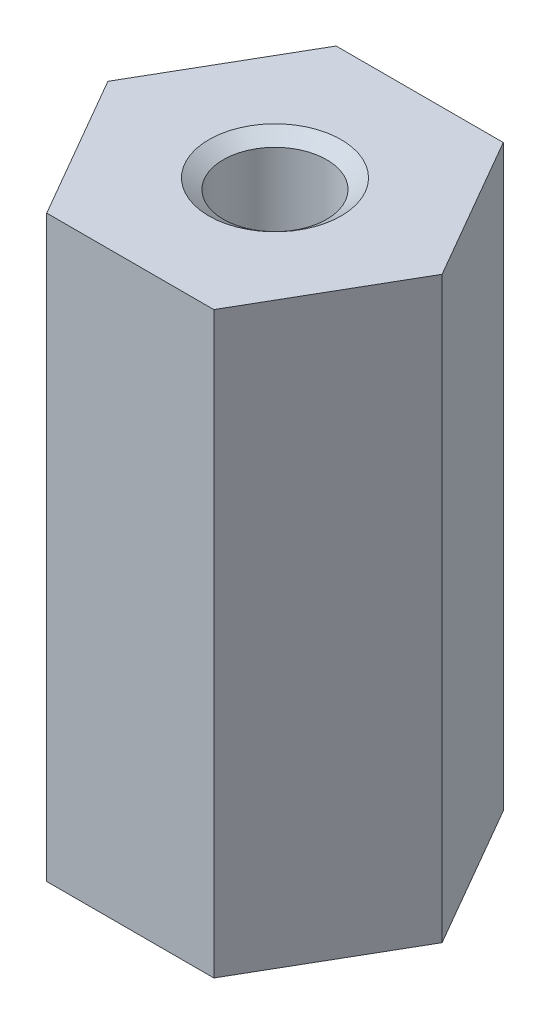
ISO-10303-21;
HEADER;
FILE_DESCRIPTION(('STEP AP214'),'2;1');
FILE_NAME('part.step','',(''),(''),'','','');
FILE_SCHEMA(('AUTOMOTIVE_DESIGN { 1 0 10303 214 1 1 1 1 }'));
ENDSEC;
DATA;
#1=APPLICATION_CONTEXT('core data for automotive mechanical design processes');
#2=APPLICATION_PROTOCOL_DEFINITION('international standard','automotive_design',2000,#1);
#3=PRODUCT_CONTEXT('',#1,'mechanical');
#4=PRODUCT('Part','Part','',(#3));
#5=PRODUCT_RELATED_PRODUCT_CATEGORY('part','',(#4));
#6=PRODUCT_DEFINITION_FORMATION('','',#4);
#7=PRODUCT_DEFINITION_CONTEXT('part definition',#1,'design');
#8=PRODUCT_DEFINITION('design','',#6,#7);
#9=PRODUCT_DEFINITION_SHAPE('','',#8);
#10=(LENGTH_UNIT() NAMED_UNIT(*) SI_UNIT(.MILLI.,.METRE.));
#11=(NAMED_UNIT(*) PLANE_ANGLE_UNIT() SI_UNIT($,.RADIAN.));
#12=(NAMED_UNIT(*) SI_UNIT($,.STERADIAN.) SOLID_ANGLE_UNIT());
#13=UNCERTAINTY_MEASURE_WITH_UNIT(LENGTH_MEASURE(1.E-05),#10,'distance_accuracy_value','');
#14=(GEOMETRIC_REPRESENTATION_CONTEXT(3) GLOBAL_UNCERTAINTY_ASSIGNED_CONTEXT((#13)) GLOBAL_UNIT_ASSIGNED_CONTEXT((#10,
#11,#12)) REPRESENTATION_CONTEXT('',''));
#15=CARTESIAN_POINT('',(0.,0.,0.));
#16=DIRECTION('',(0.,0.,1.));
#17=DIRECTION('',(1.,0.,0.));
#18=AXIS2_PLACEMENT_3D('',#15,#16,#17);
#19=CARTESIAN_POINT('',(2.02072594216369,14.,3.50000000000001));
#20=DIRECTION('',(-0.866025403784439,0.,-0.5));
#21=DIRECTION('',(-0.5,0.,0.866025403784439));
#22=AXIS2_PLACEMENT_3D('',#19,#20,#21);
#23=PLANE('',#22);
#24=DIRECTION('',(0.5,0.,-0.866025403784439));
#25=VECTOR('',#24,1.);
#26=CARTESIAN_POINT('',(2.02072594216369,0.,3.50000000000001));
#27=LINE('',#26,#25);
#28=CARTESIAN_POINT('',(2.02072594216369,0.,3.50000000000001));
#29=VERTEX_POINT('',#28);
#30=CARTESIAN_POINT('',(4.04145188432738,0.,0.));
#31=VERTEX_POINT('',#30);
#32=EDGE_CURVE('E115',#29,#31,#27,.T.);
#33=ORIENTED_EDGE('',*,*,#32,.T.);
#34=DIRECTION('',(0.,-1.,0.));
#35=VECTOR('',#34,1.);
#36=CARTESIAN_POINT('',(4.04145188432738,14.,0.));
#37=LINE('',#36,#35);
#38=CARTESIAN_POINT('',(4.04145188432738,14.,0.));
#39=VERTEX_POINT('',#38);
#40=EDGE_CURVE('E11',#39,#31,#37,.T.);
#41=ORIENTED_EDGE('',*,*,#40,.F.);
#42=DIRECTION('',(0.5,0.,-0.866025403784439));
#43=VECTOR('',#42,1.);
#44=CARTESIAN_POINT('',(2.02072594216369,14.,3.50000000000001));
#45=LINE('',#44,#43);
#46=CARTESIAN_POINT('',(2.02072594216369,14.,3.50000000000001));
#47=VERTEX_POINT('',#46);
#48=EDGE_CURVE('E126',#47,#39,#45,.T.);
#49=ORIENTED_EDGE('',*,*,#48,.F.);
#50=DIRECTION('',(0.,-1.,0.));
#51=VECTOR('',#50,1.);
#52=CARTESIAN_POINT('',(2.02072594216369,14.,3.50000000000001));
#53=LINE('',#52,#51);
#54=EDGE_CURVE('E111',#47,#29,#53,.T.);
#55=ORIENTED_EDGE('',*,*,#54,.T.);
#56=EDGE_LOOP('',(#33,#41,#49,#55));
#57=FACE_BOUND('',#56,.T.);
#58=ADVANCED_FACE('F31',(#57),#23,.F.);
#59=CARTESIAN_POINT('',(4.04145188432738,14.,0.));
#60=DIRECTION('',(-0.866025403784439,0.,0.5));
#61=DIRECTION('',(0.5,0.,0.866025403784439));
#62=AXIS2_PLACEMENT_3D('',#59,#60,#61);
#63=PLANE('',#62);
#64=DIRECTION('',(-0.5,0.,-0.866025403784439));
#65=VECTOR('',#64,1.);
#66=CARTESIAN_POINT('',(4.04145188432738,0.,0.));
#67=LINE('',#66,#65);
#68=CARTESIAN_POINT('',(2.02072594216368,0.,-3.50000000000001));
#69=VERTEX_POINT('',#68);
#70=EDGE_CURVE('E118',#31,#69,#67,.T.);
#71=ORIENTED_EDGE('',*,*,#70,.T.);
#72=DIRECTION('',(0.,-1.,0.));
#73=VECTOR('',#72,1.);
#74=CARTESIAN_POINT('',(2.02072594216368,14.,-3.50000000000001));
#75=LINE('',#74,#73);
#76=CARTESIAN_POINT('',(2.02072594216368,14.,-3.50000000000001));
#77=VERTEX_POINT('',#76);
#78=EDGE_CURVE('E39',#77,#69,#75,.T.);
#79=ORIENTED_EDGE('',*,*,#78,.F.);
#80=DIRECTION('',(-0.5,0.,-0.866025403784439));
#81=VECTOR('',#80,1.);
#82=CARTESIAN_POINT('',(4.04145188432738,14.,0.));
#83=LINE('',#82,#81);
#84=EDGE_CURVE('E84',#39,#77,#83,.T.);
#85=ORIENTED_EDGE('',*,*,#84,.F.);
#86=ORIENTED_EDGE('',*,*,#40,.T.);
#87=EDGE_LOOP('',(#71,#79,#85,#86));
#88=FACE_BOUND('',#87,.T.);
#89=ADVANCED_FACE('F151',(#88),#63,.F.);
#90=CARTESIAN_POINT('',(2.02072594216368,14.,-3.50000000000001));
#91=DIRECTION('',(0.,0.,1.));
#92=DIRECTION('',(1.,0.,0.));
#93=AXIS2_PLACEMENT_3D('',#90,#91,#92);
#94=PLANE('',#93);
#95=DIRECTION('',(-1.,0.,0.));
#96=VECTOR('',#95,1.);
#97=CARTESIAN_POINT('',(2.02072594216368,0.,-3.50000000000001));
#98=LINE('',#97,#96);
#99=CARTESIAN_POINT('',(-2.02072594216369,0.,-3.50000000000001));
#100=VERTEX_POINT('',#99);
#101=EDGE_CURVE('E121',#69,#100,#98,.T.);
#102=ORIENTED_EDGE('',*,*,#101,.T.);
#103=DIRECTION('',(0.,-1.,0.));
#104=VECTOR('',#103,1.);
#105=CARTESIAN_POINT('',(-2.02072594216369,14.,-3.50000000000001));
#106=LINE('',#105,#104);
#107=CARTESIAN_POINT('',(-2.02072594216369,14.,-3.50000000000001));
#108=VERTEX_POINT('',#107);
#109=EDGE_CURVE('E106',#108,#100,#106,.T.);
#110=ORIENTED_EDGE('',*,*,#109,.F.);
#111=DIRECTION('',(-1.,0.,0.));
#112=VECTOR('',#111,1.);
#113=CARTESIAN_POINT('',(2.02072594216368,14.,-3.50000000000001));
#114=LINE('',#113,#112);
#115=EDGE_CURVE('E97',#77,#108,#114,.T.);
#116=ORIENTED_EDGE('',*,*,#115,.F.);
#117=ORIENTED_EDGE('',*,*,#78,.T.);
#118=EDGE_LOOP('',(#102,#110,#116,#117));
#119=FACE_BOUND('',#118,.T.);
#120=ADVANCED_FACE('F132',(#119),#94,.F.);
#121=CARTESIAN_POINT('',(-2.02072594216369,14.,-3.50000000000001));
#122=DIRECTION('',(0.866025403784438,0.,0.5));
#123=DIRECTION('',(0.5,0.,-0.866025403784439));
#124=AXIS2_PLACEMENT_3D('',#121,#122,#123);
#125=PLANE('',#124);
#126=DIRECTION('',(-0.5,0.,0.866025403784438));
#127=VECTOR('',#126,1.);
#128=CARTESIAN_POINT('',(-2.02072594216369,0.,-3.50000000000001));
#129=LINE('',#128,#127);
#130=CARTESIAN_POINT('',(-4.04145188432739,0.,0.));
#131=VERTEX_POINT('',#130);
#132=EDGE_CURVE('E105',#100,#131,#129,.T.);
#133=ORIENTED_EDGE('',*,*,#132,.T.);
#134=DIRECTION('',(0.,-1.,0.));
#135=VECTOR('',#134,1.);
#136=CARTESIAN_POINT('',(-4.04145188432739,14.,0.));
#137=LINE('',#136,#135);
#138=CARTESIAN_POINT('',(-4.04145188432739,14.,0.));
#139=VERTEX_POINT('',#138);
#140=EDGE_CURVE('E102',#139,#131,#137,.T.);
#141=ORIENTED_EDGE('',*,*,#140,.F.);
#142=DIRECTION('',(-0.5,0.,0.866025403784438));
#143=VECTOR('',#142,1.);
#144=CARTESIAN_POINT('',(-2.02072594216369,14.,-3.50000000000001));
#145=LINE('',#144,#143);
#146=EDGE_CURVE('E91',#108,#139,#145,.T.);
#147=ORIENTED_EDGE('',*,*,#146,.F.);
#148=ORIENTED_EDGE('',*,*,#109,.T.);
#149=EDGE_LOOP('',(#133,#141,#147,#148));
#150=FACE_BOUND('',#149,.T.);
#151=ADVANCED_FACE('F103',(#150),#125,.F.);
#152=CARTESIAN_POINT('',(-4.04145188432739,14.,0.));
#153=DIRECTION('',(0.866025403784439,0.,-0.5));
#154=DIRECTION('',(-0.5,0.,-0.866025403784439));
#155=AXIS2_PLACEMENT_3D('',#152,#153,#154);
#156=PLANE('',#155);
#157=DIRECTION('',(0.5,0.,0.866025403784439));
#158=VECTOR('',#157,1.);
#159=CARTESIAN_POINT('',(-4.04145188432739,0.,0.));
#160=LINE('',#159,#158);
#161=CARTESIAN_POINT('',(-2.0207259421637,0.,3.50000000000001));
#162=VERTEX_POINT('',#161);
#163=EDGE_CURVE('E70',#131,#162,#160,.T.);
#164=ORIENTED_EDGE('',*,*,#163,.T.);
#165=DIRECTION('',(0.,-1.,0.));
#166=VECTOR('',#165,1.);
#167=CARTESIAN_POINT('',(-2.0207259421637,14.,3.50000000000001));
#168=LINE('',#167,#166);
#169=CARTESIAN_POINT('',(-2.0207259421637,14.,3.50000000000001));
#170=VERTEX_POINT('',#169);
#171=EDGE_CURVE('E107',#170,#162,#168,.T.);
#172=ORIENTED_EDGE('',*,*,#171,.F.);
#173=DIRECTION('',(0.5,0.,0.866025403784439));
#174=VECTOR('',#173,1.);
#175=CARTESIAN_POINT('',(-4.04145188432739,14.,0.));
#176=LINE('',#175,#174);
#177=EDGE_CURVE('E95',#139,#170,#176,.T.);
#178=ORIENTED_EDGE('',*,*,#177,.F.);
#179=ORIENTED_EDGE('',*,*,#140,.T.);
#180=EDGE_LOOP('',(#164,#172,#178,#179));
#181=FACE_BOUND('',#180,.T.);
#182=ADVANCED_FACE('F109',(#181),#156,.F.);
#183=CARTESIAN_POINT('',(-2.0207259421637,14.,3.50000000000001));
#184=DIRECTION('',(0.,0.,-1.));
#185=DIRECTION('',(-1.,0.,0.));
#186=AXIS2_PLACEMENT_3D('',#183,#184,#185);
#187=PLANE('',#186);
#188=DIRECTION('',(1.,0.,0.));
#189=VECTOR('',#188,1.);
#190=CARTESIAN_POINT('',(-2.0207259421637,0.,3.50000000000001));
#191=LINE('',#190,#189);
#192=EDGE_CURVE('E76',#162,#29,#191,.T.);
#193=ORIENTED_EDGE('',*,*,#192,.T.);
#194=ORIENTED_EDGE('',*,*,#54,.F.);
#195=DIRECTION('',(1.,0.,0.));
#196=VECTOR('',#195,1.);
#197=CARTESIAN_POINT('',(-2.0207259421637,14.,3.50000000000001));
#198=LINE('',#197,#196);
#199=EDGE_CURVE('E47',#170,#47,#198,.T.);
#200=ORIENTED_EDGE('',*,*,#199,.F.);
#201=ORIENTED_EDGE('',*,*,#171,.T.);
#202=EDGE_LOOP('',(#193,#194,#200,#201));
#203=FACE_BOUND('',#202,.T.);
#204=ADVANCED_FACE('F139',(#203),#187,.F.);
#205=CARTESIAN_POINT('',(4.04145188432738,14.,0.));
#206=DIRECTION('',(0.,1.,0.));
#207=DIRECTION('',(0.,0.,1.));
#208=AXIS2_PLACEMENT_3D('',#205,#206,#207);
#209=PLANE('',#208);
#210=CARTESIAN_POINT('',(0.,14.,0.));
#211=DIRECTION('',(0.,1.,0.));
#212=DIRECTION('',(0.,0.,1.));
#213=AXIS2_PLACEMENT_3D('',#210,#211,#212);
#214=CIRCLE('',#213,1.6);
#215=CARTESIAN_POINT('',(0.,14.,1.6));
#216=VERTEX_POINT('',#215);
#217=EDGE_CURVE('E227',#216,#216,#214,.T.);
#218=ORIENTED_EDGE('',*,*,#217,.F.);
#219=EDGE_LOOP('',(#218));
#220=FACE_BOUND('',#219,.T.);
#221=ORIENTED_EDGE('',*,*,#48,.T.);
#222=ORIENTED_EDGE('',*,*,#84,.T.);
#223=ORIENTED_EDGE('',*,*,#115,.T.);
#224=ORIENTED_EDGE('',*,*,#146,.T.);
#225=ORIENTED_EDGE('',*,*,#177,.T.);
#226=ORIENTED_EDGE('',*,*,#199,.T.);
#227=EDGE_LOOP('',(#221,#222,#223,#224,#225,#226));
#228=FACE_BOUND('',#227,.T.);
#229=ADVANCED_FACE('F93',(#220,#228),#209,.T.);
#230=CARTESIAN_POINT('',(4.04145188432738,0.,0.));
#231=DIRECTION('',(0.,1.,0.));
#232=DIRECTION('',(0.,0.,1.));
#233=AXIS2_PLACEMENT_3D('',#230,#231,#232);
#234=PLANE('',#233);
#235=CARTESIAN_POINT('',(0.,0.,0.));
#236=DIRECTION('',(0.,1.,0.));
#237=DIRECTION('',(0.,0.,1.));
#238=AXIS2_PLACEMENT_3D('',#235,#236,#237);
#239=CIRCLE('',#238,1.6);
#240=CARTESIAN_POINT('',(0.,0.,1.6));
#241=VERTEX_POINT('',#240);
#242=EDGE_CURVE('E228',#241,#241,#239,.T.);
#243=ORIENTED_EDGE('',*,*,#242,.T.);
#244=EDGE_LOOP('',(#243));
#245=FACE_BOUND('',#244,.T.);
#246=ORIENTED_EDGE('',*,*,#32,.F.);
#247=ORIENTED_EDGE('',*,*,#192,.F.);
#248=ORIENTED_EDGE('',*,*,#163,.F.);
#249=ORIENTED_EDGE('',*,*,#132,.F.);
#250=ORIENTED_EDGE('',*,*,#101,.F.);
#251=ORIENTED_EDGE('',*,*,#70,.F.);
#252=EDGE_LOOP('',(#246,#247,#248,#249,#250,#251));
#253=FACE_BOUND('',#252,.T.);
#254=ADVANCED_FACE('F135',(#245,#253),#234,.F.);
#255=CARTESIAN_POINT('',(0.,0.245072638373396,0.));
#256=DIRECTION('',(0.,-1.,0.));
#257=DIRECTION('',(0.,0.,-1.));
#258=AXIS2_PLACEMENT_3D('',#255,#256,#257);
#259=CONICAL_SURFACE('',#258,1.25,0.959931088596882);
#260=ORIENTED_EDGE('',*,*,#242,.F.);
#261=EDGE_LOOP('',(#260));
#262=FACE_BOUND('',#261,.T.);
#263=CARTESIAN_POINT('',(0.,0.245072638373396,0.));
#264=DIRECTION('',(0.,1.,0.));
#265=DIRECTION('',(0.,0.,1.));
#266=AXIS2_PLACEMENT_3D('',#263,#264,#265);
#267=CIRCLE('',#266,1.25);
#268=CARTESIAN_POINT('',(0.,0.245072638373396,1.25));
#269=VERTEX_POINT('',#268);
#270=EDGE_CURVE('E119',#269,#269,#267,.T.);
#271=ORIENTED_EDGE('',*,*,#270,.T.);
#272=EDGE_LOOP('',(#271));
#273=FACE_BOUND('',#272,.T.);
#274=ADVANCED_FACE('F188',(#262,#273),#259,.F.);
#275=CARTESIAN_POINT('',(0.,14.,0.));
#276=DIRECTION('',(0.,1.,0.));
#277=DIRECTION('',(0.,0.,1.));
#278=AXIS2_PLACEMENT_3D('',#275,#276,#277);
#279=CYLINDRICAL_SURFACE('',#278,1.25);
#280=ORIENTED_EDGE('',*,*,#270,.F.);
#281=EDGE_LOOP('',(#280));
#282=FACE_BOUND('',#281,.T.);
#283=CARTESIAN_POINT('',(0.,13.7549273616266,0.));
#284=DIRECTION('',(0.,1.,0.));
#285=DIRECTION('',(0.,0.,1.));
#286=AXIS2_PLACEMENT_3D('',#283,#284,#285);
#287=CIRCLE('',#286,1.25);
#288=CARTESIAN_POINT('',(0.,13.7549273616266,1.25));
#289=VERTEX_POINT('',#288);
#290=EDGE_CURVE('E224',#289,#289,#287,.T.);
#291=ORIENTED_EDGE('',*,*,#290,.T.);
#292=EDGE_LOOP('',(#291));
#293=FACE_BOUND('',#292,.T.);
#294=ADVANCED_FACE('F197',(#282,#293),#279,.F.);
#295=CARTESIAN_POINT('',(0.,14.,0.));
#296=DIRECTION('',(0.,1.,0.));
#297=DIRECTION('',(0.,0.,1.));
#298=AXIS2_PLACEMENT_3D('',#295,#296,#297);
#299=CONICAL_SURFACE('',#298,1.6,0.959931088596883);
#300=ORIENTED_EDGE('',*,*,#290,.F.);
#301=EDGE_LOOP('',(#300));
#302=FACE_BOUND('',#301,.T.);
#303=ORIENTED_EDGE('',*,*,#217,.T.);
#304=EDGE_LOOP('',(#303));
#305=FACE_BOUND('',#304,.T.);
#306=ADVANCED_FACE('F207',(#302,#305),#299,.F.);
#307=CLOSED_SHELL('',(#58,#89,#120,#151,#182,#204,#229,#254,#274,#294,#306));
#308=MANIFOLD_SOLID_BREP('B2',#307);
#309=ADVANCED_BREP_SHAPE_REPRESENTATION('',(#18,#308),#14);
#310=SHAPE_DEFINITION_REPRESENTATION(#9,#309);
ENDSEC;
END-ISO-10303-21;
